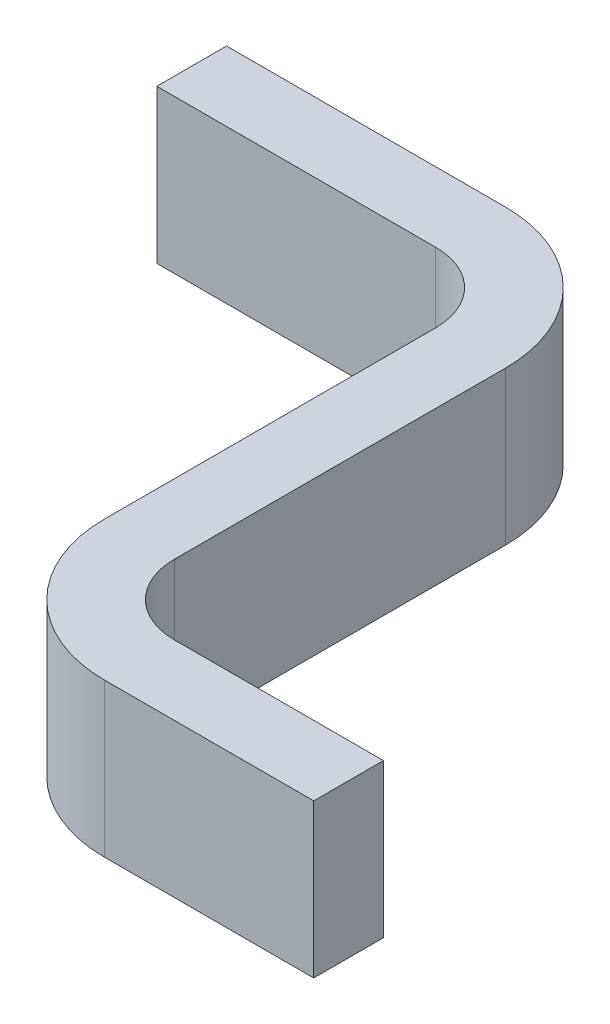
ISO-10303-21;
HEADER;
FILE_DESCRIPTION(('STEP AP214'),'2;1');
FILE_NAME('part.step','',(''),(''),'','','');
FILE_SCHEMA(('AUTOMOTIVE_DESIGN { 1 0 10303 214 1 1 1 1 }'));
ENDSEC;
DATA;
#1=APPLICATION_CONTEXT('core data for automotive mechanical design processes');
#2=APPLICATION_PROTOCOL_DEFINITION('international standard','automotive_design',2000,#1);
#3=PRODUCT_CONTEXT('',#1,'mechanical');
#4=PRODUCT('Part','Part','',(#3));
#5=PRODUCT_RELATED_PRODUCT_CATEGORY('part','',(#4));
#6=PRODUCT_DEFINITION_FORMATION('','',#4);
#7=PRODUCT_DEFINITION_CONTEXT('part definition',#1,'design');
#8=PRODUCT_DEFINITION('design','',#6,#7);
#9=PRODUCT_DEFINITION_SHAPE('','',#8);
#10=(LENGTH_UNIT() NAMED_UNIT(*) SI_UNIT(.MILLI.,.METRE.));
#11=(NAMED_UNIT(*) PLANE_ANGLE_UNIT() SI_UNIT($,.RADIAN.));
#12=(NAMED_UNIT(*) SI_UNIT($,.STERADIAN.) SOLID_ANGLE_UNIT());
#13=UNCERTAINTY_MEASURE_WITH_UNIT(LENGTH_MEASURE(1.E-05),#10,'distance_accuracy_value','');
#14=(GEOMETRIC_REPRESENTATION_CONTEXT(3) GLOBAL_UNCERTAINTY_ASSIGNED_CONTEXT((#13)) GLOBAL_UNIT_ASSIGNED_CONTEXT((#10,
#11,#12)) REPRESENTATION_CONTEXT('',''));
#15=CARTESIAN_POINT('',(0.,0.,0.));
#16=DIRECTION('',(0.,0.,1.));
#17=DIRECTION('',(1.,0.,0.));
#18=AXIS2_PLACEMENT_3D('',#15,#16,#17);
#19=CARTESIAN_POINT('',(-4.,2.36,0.675));
#20=DIRECTION('',(0.,-1.,0.));
#21=DIRECTION('',(1.,0.,0.));
#22=AXIS2_PLACEMENT_3D('',#19,#20,#21);
#23=PLANE('',#22);
#24=CARTESIAN_POINT('',(-3.8,2.36,0.675));
#25=DIRECTION('',(0.,1.,0.));
#26=DIRECTION('',(-1.,0.,0.));
#27=AXIS2_PLACEMENT_3D('',#24,#25,#26);
#28=CIRCLE('',#27,0.2);
#29=CARTESIAN_POINT('',(-3.8,2.36,0.875));
#30=VERTEX_POINT('',#29);
#31=CARTESIAN_POINT('',(-4.,2.36,0.675));
#32=VERTEX_POINT('',#31);
#33=EDGE_CURVE('E150',#30,#32,#28,.F.);
#34=ORIENTED_EDGE('',*,*,#33,.F.);
#35=DIRECTION('',(-1.,0.,0.));
#36=VECTOR('',#35,1.);
#37=CARTESIAN_POINT('',(-3.5,2.36,0.875));
#38=LINE('',#37,#36);
#39=CARTESIAN_POINT('',(-3.5,2.36,0.875));
#40=VERTEX_POINT('',#39);
#41=EDGE_CURVE('E147',#30,#40,#38,.F.);
#42=ORIENTED_EDGE('',*,*,#41,.T.);
#43=DIRECTION('',(0.,0.,1.));
#44=VECTOR('',#43,1.);
#45=CARTESIAN_POINT('',(-3.5,2.36,0.775));
#46=LINE('',#45,#44);
#47=CARTESIAN_POINT('',(-3.5,2.36,0.775));
#48=VERTEX_POINT('',#47);
#49=EDGE_CURVE('E141',#48,#40,#46,.T.);
#50=ORIENTED_EDGE('',*,*,#49,.F.);
#51=DIRECTION('',(1.,0.,0.));
#52=VECTOR('',#51,1.);
#53=CARTESIAN_POINT('',(-3.5,2.36,0.775));
#54=LINE('',#53,#52);
#55=CARTESIAN_POINT('',(-3.8,2.36,0.775));
#56=VERTEX_POINT('',#55);
#57=EDGE_CURVE('E115',#48,#56,#54,.F.);
#58=ORIENTED_EDGE('',*,*,#57,.T.);
#59=CARTESIAN_POINT('',(-3.8,2.36,0.675));
#60=DIRECTION('',(0.,1.,0.));
#61=DIRECTION('',(-1.,0.,0.));
#62=AXIS2_PLACEMENT_3D('',#59,#60,#61);
#63=CIRCLE('',#62,0.1);
#64=CARTESIAN_POINT('',(-3.9,2.36,0.675));
#65=VERTEX_POINT('',#64);
#66=EDGE_CURVE('E215',#56,#65,#63,.F.);
#67=ORIENTED_EDGE('',*,*,#66,.T.);
#68=DIRECTION('',(0.,0.,1.));
#69=VECTOR('',#68,1.);
#70=CARTESIAN_POINT('',(-3.9,2.36,0.675));
#71=LINE('',#70,#69);
#72=CARTESIAN_POINT('',(-3.9,2.36,0.2));
#73=VERTEX_POINT('',#72);
#74=EDGE_CURVE('E181',#65,#73,#71,.F.);
#75=ORIENTED_EDGE('',*,*,#74,.T.);
#76=CARTESIAN_POINT('',(-4.1,2.36,0.2));
#77=DIRECTION('',(0.,-1.,0.));
#78=DIRECTION('',(1.,0.,0.));
#79=AXIS2_PLACEMENT_3D('',#76,#77,#78);
#80=CIRCLE('',#79,0.2);
#81=CARTESIAN_POINT('',(-4.1,2.36,0.));
#82=VERTEX_POINT('',#81);
#83=EDGE_CURVE('E20',#82,#73,#80,.T.);
#84=ORIENTED_EDGE('',*,*,#83,.F.);
#85=DIRECTION('',(1.,0.,0.));
#86=VECTOR('',#85,1.);
#87=CARTESIAN_POINT('',(-4.1,2.36,0.));
#88=LINE('',#87,#86);
#89=CARTESIAN_POINT('',(-4.5,2.36,0.));
#90=VERTEX_POINT('',#89);
#91=EDGE_CURVE('E91',#82,#90,#88,.F.);
#92=ORIENTED_EDGE('',*,*,#91,.T.);
#93=DIRECTION('',(0.,0.,1.));
#94=VECTOR('',#93,1.);
#95=CARTESIAN_POINT('',(-4.5,2.36,0.));
#96=LINE('',#95,#94);
#97=CARTESIAN_POINT('',(-4.5,2.36,0.1));
#98=VERTEX_POINT('',#97);
#99=EDGE_CURVE('E163',#90,#98,#96,.T.);
#100=ORIENTED_EDGE('',*,*,#99,.T.);
#101=DIRECTION('',(-1.,0.,0.));
#102=VECTOR('',#101,1.);
#103=CARTESIAN_POINT('',(-4.1,2.36,0.1));
#104=LINE('',#103,#102);
#105=CARTESIAN_POINT('',(-4.1,2.36,0.1));
#106=VERTEX_POINT('',#105);
#107=EDGE_CURVE('E159',#98,#106,#104,.F.);
#108=ORIENTED_EDGE('',*,*,#107,.T.);
#109=CARTESIAN_POINT('',(-4.1,2.36,0.2));
#110=DIRECTION('',(0.,-1.,0.));
#111=DIRECTION('',(1.,0.,0.));
#112=AXIS2_PLACEMENT_3D('',#109,#110,#111);
#113=CIRCLE('',#112,0.1);
#114=CARTESIAN_POINT('',(-4.,2.36,0.2));
#115=VERTEX_POINT('',#114);
#116=EDGE_CURVE('E155',#106,#115,#113,.T.);
#117=ORIENTED_EDGE('',*,*,#116,.T.);
#118=DIRECTION('',(0.,0.,1.));
#119=VECTOR('',#118,1.);
#120=CARTESIAN_POINT('',(-4.,2.36,0.675));
#121=LINE('',#120,#119);
#122=EDGE_CURVE('E154',#115,#32,#121,.T.);
#123=ORIENTED_EDGE('',*,*,#122,.T.);
#124=EDGE_LOOP('',(#34,#42,#50,#58,#67,#75,#84,#92,#100,#108,#117,#123));
#125=FACE_BOUND('',#124,.T.);
#126=ADVANCED_FACE('F17',(#125),#23,.F.);
#127=CARTESIAN_POINT('',(-4.1,2.36,0.2));
#128=DIRECTION('',(0.,-1.,0.));
#129=DIRECTION('',(1.,0.,0.));
#130=AXIS2_PLACEMENT_3D('',#127,#128,#129);
#131=CYLINDRICAL_SURFACE('',#130,0.2);
#132=CARTESIAN_POINT('',(-4.1,2.14,0.2));
#133=DIRECTION('',(0.,-1.,0.));
#134=DIRECTION('',(1.,0.,0.));
#135=AXIS2_PLACEMENT_3D('',#132,#133,#134);
#136=CIRCLE('',#135,0.2);
#137=CARTESIAN_POINT('',(-3.9,2.14,0.2));
#138=VERTEX_POINT('',#137);
#139=CARTESIAN_POINT('',(-4.1,2.14,0.));
#140=VERTEX_POINT('',#139);
#141=EDGE_CURVE('E183',#138,#140,#136,.F.);
#142=ORIENTED_EDGE('',*,*,#141,.T.);
#143=DIRECTION('',(0.,1.,0.));
#144=VECTOR('',#143,1.);
#145=CARTESIAN_POINT('',(-4.1,2.36,0.));
#146=LINE('',#145,#144);
#147=EDGE_CURVE('E178',#140,#82,#146,.T.);
#148=ORIENTED_EDGE('',*,*,#147,.T.);
#149=ORIENTED_EDGE('',*,*,#83,.T.);
#150=DIRECTION('',(0.,-1.,0.));
#151=VECTOR('',#150,1.);
#152=CARTESIAN_POINT('',(-3.9,2.36,0.2));
#153=LINE('',#152,#151);
#154=EDGE_CURVE('E217',#73,#138,#153,.T.);
#155=ORIENTED_EDGE('',*,*,#154,.T.);
#156=EDGE_LOOP('',(#142,#148,#149,#155));
#157=FACE_BOUND('',#156,.T.);
#158=ADVANCED_FACE('F254',(#157),#131,.T.);
#159=CARTESIAN_POINT('',(-4.1,2.36,0.));
#160=DIRECTION('',(0.,0.,1.));
#161=DIRECTION('',(1.,0.,0.));
#162=AXIS2_PLACEMENT_3D('',#159,#160,#161);
#163=PLANE('',#162);
#164=ORIENTED_EDGE('',*,*,#147,.F.);
#165=DIRECTION('',(-1.,0.,0.));
#166=VECTOR('',#165,1.);
#167=CARTESIAN_POINT('',(-3.9,2.14,0.));
#168=LINE('',#167,#166);
#169=CARTESIAN_POINT('',(-4.5,2.14,0.));
#170=VERTEX_POINT('',#169);
#171=EDGE_CURVE('E170',#140,#170,#168,.T.);
#172=ORIENTED_EDGE('',*,*,#171,.T.);
#173=DIRECTION('',(0.,1.,0.));
#174=VECTOR('',#173,1.);
#175=CARTESIAN_POINT('',(-4.5,2.36,0.));
#176=LINE('',#175,#174);
#177=EDGE_CURVE('E173',#170,#90,#176,.T.);
#178=ORIENTED_EDGE('',*,*,#177,.T.);
#179=ORIENTED_EDGE('',*,*,#91,.F.);
#180=EDGE_LOOP('',(#164,#172,#178,#179));
#181=FACE_BOUND('',#180,.T.);
#182=ADVANCED_FACE('F257',(#181),#163,.F.);
#183=CARTESIAN_POINT('',(-4.5,2.36,0.));
#184=DIRECTION('',(1.,0.,0.));
#185=DIRECTION('',(0.,1.,0.));
#186=AXIS2_PLACEMENT_3D('',#183,#184,#185);
#187=PLANE('',#186);
#188=DIRECTION('',(0.,1.,0.));
#189=VECTOR('',#188,1.);
#190=CARTESIAN_POINT('',(-4.5,2.14,0.1));
#191=LINE('',#190,#189);
#192=CARTESIAN_POINT('',(-4.5,2.14,0.1));
#193=VERTEX_POINT('',#192);
#194=EDGE_CURVE('E160',#193,#98,#191,.T.);
#195=ORIENTED_EDGE('',*,*,#194,.T.);
#196=ORIENTED_EDGE('',*,*,#99,.F.);
#197=ORIENTED_EDGE('',*,*,#177,.F.);
#198=DIRECTION('',(0.,0.,1.));
#199=VECTOR('',#198,1.);
#200=CARTESIAN_POINT('',(-4.5,2.14,0.675));
#201=LINE('',#200,#199);
#202=EDGE_CURVE('E166',#170,#193,#201,.T.);
#203=ORIENTED_EDGE('',*,*,#202,.T.);
#204=EDGE_LOOP('',(#195,#196,#197,#203));
#205=FACE_BOUND('',#204,.T.);
#206=ADVANCED_FACE('F259',(#205),#187,.F.);
#207=CARTESIAN_POINT('',(-4.1,2.14,0.1));
#208=DIRECTION('',(0.,0.,-1.));
#209=DIRECTION('',(-1.,0.,0.));
#210=AXIS2_PLACEMENT_3D('',#207,#208,#209);
#211=PLANE('',#210);
#212=DIRECTION('',(0.,-1.,0.));
#213=VECTOR('',#212,1.);
#214=CARTESIAN_POINT('',(-4.1,2.14,0.1));
#215=LINE('',#214,#213);
#216=CARTESIAN_POINT('',(-4.1,2.14,0.1));
#217=VERTEX_POINT('',#216);
#218=EDGE_CURVE('E156',#217,#106,#215,.F.);
#219=ORIENTED_EDGE('',*,*,#218,.T.);
#220=ORIENTED_EDGE('',*,*,#107,.F.);
#221=ORIENTED_EDGE('',*,*,#194,.F.);
#222=DIRECTION('',(-1.,0.,0.));
#223=VECTOR('',#222,1.);
#224=CARTESIAN_POINT('',(-3.9,2.14,0.1));
#225=LINE('',#224,#223);
#226=EDGE_CURVE('E169',#193,#217,#225,.F.);
#227=ORIENTED_EDGE('',*,*,#226,.T.);
#228=EDGE_LOOP('',(#219,#220,#221,#227));
#229=FACE_BOUND('',#228,.T.);
#230=ADVANCED_FACE('F234',(#229),#211,.F.);
#231=CARTESIAN_POINT('',(-4.1,2.14,0.2));
#232=DIRECTION('',(0.,-1.,0.));
#233=DIRECTION('',(1.,0.,0.));
#234=AXIS2_PLACEMENT_3D('',#231,#232,#233);
#235=CYLINDRICAL_SURFACE('',#234,0.1);
#236=DIRECTION('',(0.,1.,0.));
#237=VECTOR('',#236,1.);
#238=CARTESIAN_POINT('',(-4.,2.14,0.2));
#239=LINE('',#238,#237);
#240=CARTESIAN_POINT('',(-4.,2.14,0.2));
#241=VERTEX_POINT('',#240);
#242=EDGE_CURVE('E151',#241,#115,#239,.T.);
#243=ORIENTED_EDGE('',*,*,#242,.T.);
#244=ORIENTED_EDGE('',*,*,#116,.F.);
#245=ORIENTED_EDGE('',*,*,#218,.F.);
#246=CARTESIAN_POINT('',(-4.1,2.14,0.2));
#247=DIRECTION('',(0.,-1.,0.));
#248=DIRECTION('',(1.,0.,0.));
#249=AXIS2_PLACEMENT_3D('',#246,#247,#248);
#250=CIRCLE('',#249,0.1);
#251=EDGE_CURVE('E210',#217,#241,#250,.T.);
#252=ORIENTED_EDGE('',*,*,#251,.T.);
#253=EDGE_LOOP('',(#243,#244,#245,#252));
#254=FACE_BOUND('',#253,.T.);
#255=ADVANCED_FACE('F227',(#254),#235,.F.);
#256=CARTESIAN_POINT('',(-4.,2.14,0.675));
#257=DIRECTION('',(1.,0.,0.));
#258=DIRECTION('',(0.,1.,0.));
#259=AXIS2_PLACEMENT_3D('',#256,#257,#258);
#260=PLANE('',#259);
#261=DIRECTION('',(0.,1.,0.));
#262=VECTOR('',#261,1.);
#263=CARTESIAN_POINT('',(-4.,2.14,0.675));
#264=LINE('',#263,#262);
#265=CARTESIAN_POINT('',(-4.,2.14,0.675));
#266=VERTEX_POINT('',#265);
#267=EDGE_CURVE('E148',#32,#266,#264,.F.);
#268=ORIENTED_EDGE('',*,*,#267,.F.);
#269=ORIENTED_EDGE('',*,*,#122,.F.);
#270=ORIENTED_EDGE('',*,*,#242,.F.);
#271=DIRECTION('',(0.,0.,1.));
#272=VECTOR('',#271,1.);
#273=CARTESIAN_POINT('',(-4.,2.14,0.675));
#274=LINE('',#273,#272);
#275=EDGE_CURVE('E209',#241,#266,#274,.T.);
#276=ORIENTED_EDGE('',*,*,#275,.T.);
#277=EDGE_LOOP('',(#268,#269,#270,#276));
#278=FACE_BOUND('',#277,.T.);
#279=ADVANCED_FACE('F224',(#278),#260,.F.);
#280=CARTESIAN_POINT('',(-3.8,2.14,0.675));
#281=DIRECTION('',(0.,1.,0.));
#282=DIRECTION('',(-1.,0.,0.));
#283=AXIS2_PLACEMENT_3D('',#280,#281,#282);
#284=CYLINDRICAL_SURFACE('',#283,0.2);
#285=ORIENTED_EDGE('',*,*,#33,.T.);
#286=ORIENTED_EDGE('',*,*,#267,.T.);
#287=CARTESIAN_POINT('',(-3.8,2.14,0.675));
#288=DIRECTION('',(0.,1.,0.));
#289=DIRECTION('',(-1.,0.,0.));
#290=AXIS2_PLACEMENT_3D('',#287,#288,#289);
#291=CIRCLE('',#290,0.2);
#292=CARTESIAN_POINT('',(-3.8,2.14,0.875));
#293=VERTEX_POINT('',#292);
#294=EDGE_CURVE('E133',#266,#293,#291,.T.);
#295=ORIENTED_EDGE('',*,*,#294,.T.);
#296=DIRECTION('',(0.,1.,0.));
#297=VECTOR('',#296,1.);
#298=CARTESIAN_POINT('',(-3.8,2.14,0.875));
#299=LINE('',#298,#297);
#300=EDGE_CURVE('E144',#293,#30,#299,.T.);
#301=ORIENTED_EDGE('',*,*,#300,.T.);
#302=EDGE_LOOP('',(#285,#286,#295,#301));
#303=FACE_BOUND('',#302,.T.);
#304=ADVANCED_FACE('F285',(#303),#284,.T.);
#305=CARTESIAN_POINT('',(-3.5,2.14,0.875));
#306=DIRECTION('',(0.,0.,-1.));
#307=DIRECTION('',(-1.,0.,0.));
#308=AXIS2_PLACEMENT_3D('',#305,#306,#307);
#309=PLANE('',#308);
#310=DIRECTION('',(0.,1.,0.));
#311=VECTOR('',#310,1.);
#312=CARTESIAN_POINT('',(-3.5,2.36,0.875));
#313=LINE('',#312,#311);
#314=CARTESIAN_POINT('',(-3.5,2.14,0.875));
#315=VERTEX_POINT('',#314);
#316=EDGE_CURVE('E118',#40,#315,#313,.F.);
#317=ORIENTED_EDGE('',*,*,#316,.F.);
#318=ORIENTED_EDGE('',*,*,#41,.F.);
#319=ORIENTED_EDGE('',*,*,#300,.F.);
#320=DIRECTION('',(-1.,0.,0.));
#321=VECTOR('',#320,1.);
#322=CARTESIAN_POINT('',(-3.9,2.14,0.875));
#323=LINE('',#322,#321);
#324=EDGE_CURVE('E131',#293,#315,#323,.F.);
#325=ORIENTED_EDGE('',*,*,#324,.T.);
#326=EDGE_LOOP('',(#317,#318,#319,#325));
#327=FACE_BOUND('',#326,.T.);
#328=ADVANCED_FACE('F282',(#327),#309,.F.);
#329=CARTESIAN_POINT('',(-3.5,2.36,0.775));
#330=DIRECTION('',(1.,0.,0.));
#331=DIRECTION('',(0.,1.,0.));
#332=AXIS2_PLACEMENT_3D('',#329,#330,#331);
#333=PLANE('',#332);
#334=ORIENTED_EDGE('',*,*,#49,.T.);
#335=ORIENTED_EDGE('',*,*,#316,.T.);
#336=DIRECTION('',(0.,0.,1.));
#337=VECTOR('',#336,1.);
#338=CARTESIAN_POINT('',(-3.5,2.14,0.675));
#339=LINE('',#338,#337);
#340=CARTESIAN_POINT('',(-3.5,2.14,0.775));
#341=VERTEX_POINT('',#340);
#342=EDGE_CURVE('E125',#315,#341,#339,.F.);
#343=ORIENTED_EDGE('',*,*,#342,.T.);
#344=DIRECTION('',(0.,1.,0.));
#345=VECTOR('',#344,1.);
#346=CARTESIAN_POINT('',(-3.5,2.36,0.775));
#347=LINE('',#346,#345);
#348=EDGE_CURVE('E110',#341,#48,#347,.T.);
#349=ORIENTED_EDGE('',*,*,#348,.T.);
#350=EDGE_LOOP('',(#334,#335,#343,#349));
#351=FACE_BOUND('',#350,.T.);
#352=ADVANCED_FACE('F129',(#351),#333,.T.);
#353=CARTESIAN_POINT('',(-3.5,2.36,0.775));
#354=DIRECTION('',(0.,0.,1.));
#355=DIRECTION('',(1.,0.,0.));
#356=AXIS2_PLACEMENT_3D('',#353,#354,#355);
#357=PLANE('',#356);
#358=ORIENTED_EDGE('',*,*,#348,.F.);
#359=DIRECTION('',(-1.,0.,0.));
#360=VECTOR('',#359,1.);
#361=CARTESIAN_POINT('',(-3.9,2.14,0.775));
#362=LINE('',#361,#360);
#363=CARTESIAN_POINT('',(-3.8,2.14,0.775));
#364=VERTEX_POINT('',#363);
#365=EDGE_CURVE('E114',#341,#364,#362,.T.);
#366=ORIENTED_EDGE('',*,*,#365,.T.);
#367=DIRECTION('',(0.,1.,0.));
#368=VECTOR('',#367,1.);
#369=CARTESIAN_POINT('',(-3.8,2.36,0.775));
#370=LINE('',#369,#368);
#371=EDGE_CURVE('E185',#364,#56,#370,.T.);
#372=ORIENTED_EDGE('',*,*,#371,.T.);
#373=ORIENTED_EDGE('',*,*,#57,.F.);
#374=EDGE_LOOP('',(#358,#366,#372,#373));
#375=FACE_BOUND('',#374,.T.);
#376=ADVANCED_FACE('F112',(#375),#357,.F.);
#377=CARTESIAN_POINT('',(-3.8,2.36,0.675));
#378=DIRECTION('',(0.,1.,0.));
#379=DIRECTION('',(-1.,0.,0.));
#380=AXIS2_PLACEMENT_3D('',#377,#378,#379);
#381=CYLINDRICAL_SURFACE('',#380,0.1);
#382=ORIENTED_EDGE('',*,*,#371,.F.);
#383=CARTESIAN_POINT('',(-3.8,2.14,0.675));
#384=DIRECTION('',(0.,1.,0.));
#385=DIRECTION('',(-1.,0.,0.));
#386=AXIS2_PLACEMENT_3D('',#383,#384,#385);
#387=CIRCLE('',#386,0.1);
#388=CARTESIAN_POINT('',(-3.9,2.14,0.675));
#389=VERTEX_POINT('',#388);
#390=EDGE_CURVE('E26',#364,#389,#387,.F.);
#391=ORIENTED_EDGE('',*,*,#390,.T.);
#392=DIRECTION('',(0.,-1.,0.));
#393=VECTOR('',#392,1.);
#394=CARTESIAN_POINT('',(-3.9,2.36,0.675));
#395=LINE('',#394,#393);
#396=EDGE_CURVE('E34',#389,#65,#395,.F.);
#397=ORIENTED_EDGE('',*,*,#396,.T.);
#398=ORIENTED_EDGE('',*,*,#66,.F.);
#399=EDGE_LOOP('',(#382,#391,#397,#398));
#400=FACE_BOUND('',#399,.T.);
#401=ADVANCED_FACE('F250',(#400),#381,.F.);
#402=CARTESIAN_POINT('',(-3.9,2.36,0.675));
#403=DIRECTION('',(-1.,0.,0.));
#404=DIRECTION('',(0.,-1.,0.));
#405=AXIS2_PLACEMENT_3D('',#402,#403,#404);
#406=PLANE('',#405);
#407=ORIENTED_EDGE('',*,*,#396,.F.);
#408=DIRECTION('',(0.,0.,1.));
#409=VECTOR('',#408,1.);
#410=CARTESIAN_POINT('',(-3.9,2.14,0.675));
#411=LINE('',#410,#409);
#412=EDGE_CURVE('E11',#389,#138,#411,.F.);
#413=ORIENTED_EDGE('',*,*,#412,.T.);
#414=ORIENTED_EDGE('',*,*,#154,.F.);
#415=ORIENTED_EDGE('',*,*,#74,.F.);
#416=EDGE_LOOP('',(#407,#413,#414,#415));
#417=FACE_BOUND('',#416,.T.);
#418=ADVANCED_FACE('F252',(#417),#406,.F.);
#419=CARTESIAN_POINT('',(-3.9,2.14,0.675));
#420=DIRECTION('',(0.,1.,0.));
#421=DIRECTION('',(-1.,0.,0.));
#422=AXIS2_PLACEMENT_3D('',#419,#420,#421);
#423=PLANE('',#422);
#424=ORIENTED_EDGE('',*,*,#390,.F.);
#425=ORIENTED_EDGE('',*,*,#365,.F.);
#426=ORIENTED_EDGE('',*,*,#342,.F.);
#427=ORIENTED_EDGE('',*,*,#324,.F.);
#428=ORIENTED_EDGE('',*,*,#294,.F.);
#429=ORIENTED_EDGE('',*,*,#275,.F.);
#430=ORIENTED_EDGE('',*,*,#251,.F.);
#431=ORIENTED_EDGE('',*,*,#226,.F.);
#432=ORIENTED_EDGE('',*,*,#202,.F.);
#433=ORIENTED_EDGE('',*,*,#171,.F.);
#434=ORIENTED_EDGE('',*,*,#141,.F.);
#435=ORIENTED_EDGE('',*,*,#412,.F.);
#436=EDGE_LOOP('',(#424,#425,#426,#427,#428,#429,#430,#431,#432,#433,#434,#435));
#437=FACE_BOUND('',#436,.T.);
#438=ADVANCED_FACE('F123',(#437),#423,.F.);
#439=CLOSED_SHELL('',(#126,#158,#182,#206,#230,#255,#279,#304,#328,#352,#376,#401,#418,#438));
#440=MANIFOLD_SOLID_BREP('B1',#439);
#441=ADVANCED_BREP_SHAPE_REPRESENTATION('',(#18,#440),#14);
#442=SHAPE_DEFINITION_REPRESENTATION(#9,#441);
ENDSEC;
END-ISO-10303-21;
